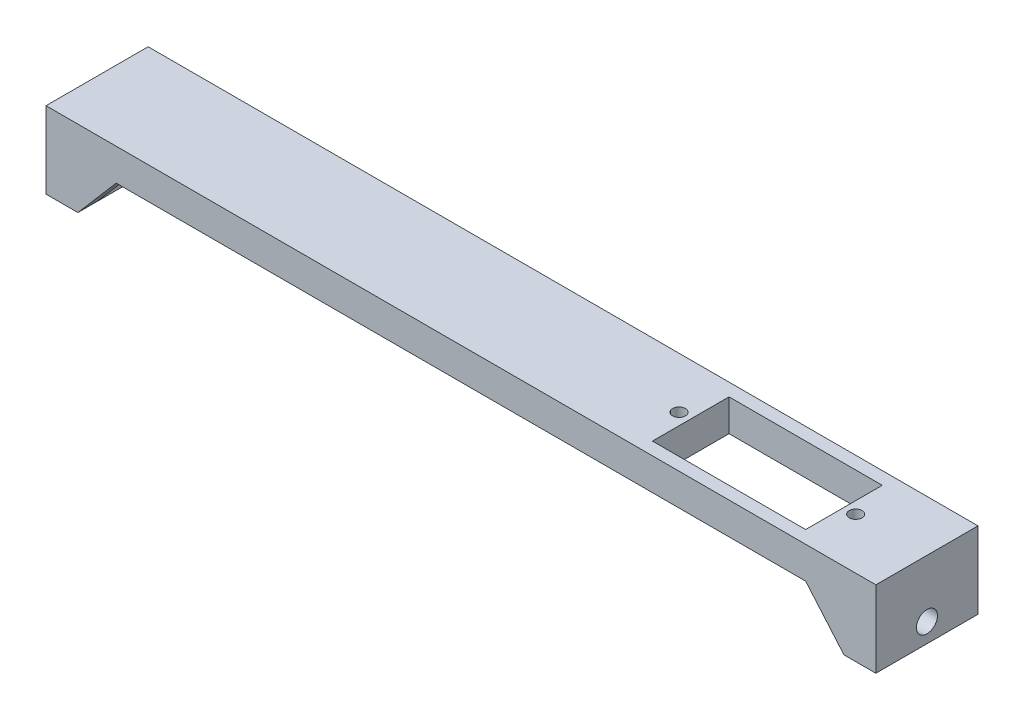
ISO-10303-21;
HEADER;
FILE_DESCRIPTION(('STEP AP214'),'2;1');
FILE_NAME('part.step','',(''),(''),'','','');
FILE_SCHEMA(('AUTOMOTIVE_DESIGN { 1 0 10303 214 1 1 1 1 }'));
ENDSEC;
DATA;
#1=APPLICATION_CONTEXT('core data for automotive mechanical design processes');
#2=APPLICATION_PROTOCOL_DEFINITION('international standard','automotive_design',2000,#1);
#3=PRODUCT_CONTEXT('',#1,'mechanical');
#4=PRODUCT('Part','Part','',(#3));
#5=PRODUCT_RELATED_PRODUCT_CATEGORY('part','',(#4));
#6=PRODUCT_DEFINITION_FORMATION('','',#4);
#7=PRODUCT_DEFINITION_CONTEXT('part definition',#1,'design');
#8=PRODUCT_DEFINITION('design','',#6,#7);
#9=PRODUCT_DEFINITION_SHAPE('','',#8);
#10=(LENGTH_UNIT() NAMED_UNIT(*) SI_UNIT(.MILLI.,.METRE.));
#11=(NAMED_UNIT(*) PLANE_ANGLE_UNIT() SI_UNIT($,.RADIAN.));
#12=(NAMED_UNIT(*) SI_UNIT($,.STERADIAN.) SOLID_ANGLE_UNIT());
#13=UNCERTAINTY_MEASURE_WITH_UNIT(LENGTH_MEASURE(1.E-05),#10,'distance_accuracy_value','');
#14=(GEOMETRIC_REPRESENTATION_CONTEXT(3) GLOBAL_UNCERTAINTY_ASSIGNED_CONTEXT((#13)) GLOBAL_UNIT_ASSIGNED_CONTEXT((#10,
#11,#12)) REPRESENTATION_CONTEXT('',''));
#15=CARTESIAN_POINT('',(0.,0.,0.));
#16=DIRECTION('',(0.,0.,1.));
#17=DIRECTION('',(1.,0.,0.));
#18=AXIS2_PLACEMENT_3D('',#15,#16,#17);
#19=CARTESIAN_POINT('',(60.,-5.00000000000001,16.));
#20=DIRECTION('',(0.,1.,0.));
#21=DIRECTION('',(0.,0.,1.));
#22=AXIS2_PLACEMENT_3D('',#19,#20,#21);
#23=PLANE('',#22);
#24=CARTESIAN_POINT('',(53.835,-5.00000000000001,8.));
#25=DIRECTION('',(0.,-1.,0.));
#26=DIRECTION('',(0.,0.,-1.));
#27=AXIS2_PLACEMENT_3D('',#24,#25,#26);
#28=CIRCLE('',#27,0.999999999999998);
#29=CARTESIAN_POINT('',(53.835,-5.00000000000001,7.));
#30=VERTEX_POINT('',#29);
#31=EDGE_CURVE('E617',#30,#30,#28,.T.);
#32=ORIENTED_EDGE('',*,*,#31,.F.);
#33=EDGE_LOOP('',(#32));
#34=FACE_BOUND('',#33,.T.);
#35=CARTESIAN_POINT('',(26.165,-5.00000000000001,8.));
#36=DIRECTION('',(0.,-1.,0.));
#37=DIRECTION('',(0.,0.,-1.));
#38=AXIS2_PLACEMENT_3D('',#35,#36,#37);
#39=CIRCLE('',#38,1.);
#40=CARTESIAN_POINT('',(26.165,-5.00000000000001,6.99999999999999));
#41=VERTEX_POINT('',#40);
#42=EDGE_CURVE('E185',#41,#41,#39,.T.);
#43=ORIENTED_EDGE('',*,*,#42,.F.);
#44=EDGE_LOOP('',(#43));
#45=FACE_BOUND('',#44,.T.);
#46=DIRECTION('',(-1.,0.,0.));
#47=VECTOR('',#46,1.);
#48=CARTESIAN_POINT('',(52.,-5.00000000000001,14.));
#49=LINE('',#48,#47);
#50=CARTESIAN_POINT('',(52.,-5.00000000000001,14.));
#51=VERTEX_POINT('',#50);
#52=CARTESIAN_POINT('',(28.,-5.00000000000001,14.));
#53=VERTEX_POINT('',#52);
#54=EDGE_CURVE('E191',#51,#53,#49,.T.);
#55=ORIENTED_EDGE('',*,*,#54,.F.);
#56=DIRECTION('',(0.,0.,1.));
#57=VECTOR('',#56,1.);
#58=CARTESIAN_POINT('',(52.,-5.00000000000001,2.));
#59=LINE('',#58,#57);
#60=CARTESIAN_POINT('',(52.,-5.00000000000001,2.));
#61=VERTEX_POINT('',#60);
#62=EDGE_CURVE('E53',#61,#51,#59,.T.);
#63=ORIENTED_EDGE('',*,*,#62,.F.);
#64=DIRECTION('',(-1.,0.,0.));
#65=VECTOR('',#64,1.);
#66=CARTESIAN_POINT('',(52.,-5.00000000000001,2.));
#67=LINE('',#66,#65);
#68=CARTESIAN_POINT('',(28.,-5.00000000000001,2.));
#69=VERTEX_POINT('',#68);
#70=EDGE_CURVE('E179',#61,#69,#67,.T.);
#71=ORIENTED_EDGE('',*,*,#70,.T.);
#72=DIRECTION('',(0.,0.,1.));
#73=VECTOR('',#72,1.);
#74=CARTESIAN_POINT('',(28.,-5.00000000000001,2.));
#75=LINE('',#74,#73);
#76=EDGE_CURVE('E182',#69,#53,#75,.T.);
#77=ORIENTED_EDGE('',*,*,#76,.T.);
#78=EDGE_LOOP('',(#55,#63,#71,#77));
#79=FACE_BOUND('',#78,.T.);
#80=DIRECTION('',(-1.,0.,0.));
#81=VECTOR('',#80,1.);
#82=CARTESIAN_POINT('',(54.,-5.00000000000001,13.));
#83=LINE('',#82,#81);
#84=CARTESIAN_POINT('',(60.,-5.00000000000001,13.));
#85=VERTEX_POINT('',#84);
#86=CARTESIAN_POINT('',(54.,-5.00000000000001,13.));
#87=VERTEX_POINT('',#86);
#88=EDGE_CURVE('E202',#85,#87,#83,.T.);
#89=ORIENTED_EDGE('',*,*,#88,.T.);
#90=DIRECTION('',(0.,0.,1.));
#91=VECTOR('',#90,1.);
#92=CARTESIAN_POINT('',(54.,-5.00000000000001,13.));
#93=LINE('',#92,#91);
#94=CARTESIAN_POINT('',(54.,-5.00000000000001,16.));
#95=VERTEX_POINT('',#94);
#96=EDGE_CURVE('E210',#87,#95,#93,.T.);
#97=ORIENTED_EDGE('',*,*,#96,.T.);
#98=DIRECTION('',(1.,0.,0.));
#99=VECTOR('',#98,1.);
#100=CARTESIAN_POINT('',(60.,-5.00000000000001,16.));
#101=LINE('',#100,#99);
#102=CARTESIAN_POINT('',(-54.,-5.00000000000001,16.));
#103=VERTEX_POINT('',#102);
#104=EDGE_CURVE('E280',#103,#95,#101,.T.);
#105=ORIENTED_EDGE('',*,*,#104,.F.);
#106=DIRECTION('',(0.,0.,1.));
#107=VECTOR('',#106,1.);
#108=CARTESIAN_POINT('',(-54.,-5.00000000000001,13.));
#109=LINE('',#108,#107);
#110=CARTESIAN_POINT('',(-54.,-5.00000000000001,13.));
#111=VERTEX_POINT('',#110);
#112=EDGE_CURVE('E240',#111,#103,#109,.T.);
#113=ORIENTED_EDGE('',*,*,#112,.F.);
#114=DIRECTION('',(1.,0.,0.));
#115=VECTOR('',#114,1.);
#116=CARTESIAN_POINT('',(-54.,-5.00000000000001,13.));
#117=LINE('',#116,#115);
#118=CARTESIAN_POINT('',(-60.,-5.00000000000001,13.));
#119=VERTEX_POINT('',#118);
#120=EDGE_CURVE('E233',#119,#111,#117,.T.);
#121=ORIENTED_EDGE('',*,*,#120,.F.);
#122=DIRECTION('',(0.,0.,-1.));
#123=VECTOR('',#122,1.);
#124=CARTESIAN_POINT('',(-60.,-5.00000000000001,16.));
#125=LINE('',#124,#123);
#126=CARTESIAN_POINT('',(-60.,-5.00000000000001,3.));
#127=VERTEX_POINT('',#126);
#128=EDGE_CURVE('E315',#119,#127,#125,.T.);
#129=ORIENTED_EDGE('',*,*,#128,.T.);
#130=DIRECTION('',(1.,0.,0.));
#131=VECTOR('',#130,1.);
#132=CARTESIAN_POINT('',(-54.,-5.00000000000001,3.));
#133=LINE('',#132,#131);
#134=CARTESIAN_POINT('',(-54.,-5.00000000000001,3.));
#135=VERTEX_POINT('',#134);
#136=EDGE_CURVE('E245',#127,#135,#133,.T.);
#137=ORIENTED_EDGE('',*,*,#136,.T.);
#138=DIRECTION('',(0.,0.,-1.));
#139=VECTOR('',#138,1.);
#140=CARTESIAN_POINT('',(-54.,-5.00000000000001,3.));
#141=LINE('',#140,#139);
#142=CARTESIAN_POINT('',(-54.,-5.,0.));
#143=VERTEX_POINT('',#142);
#144=EDGE_CURVE('E253',#135,#143,#141,.T.);
#145=ORIENTED_EDGE('',*,*,#144,.T.);
#146=DIRECTION('',(1.,0.,0.));
#147=VECTOR('',#146,1.);
#148=CARTESIAN_POINT('',(60.,-5.00000000000001,0.));
#149=LINE('',#148,#147);
#150=CARTESIAN_POINT('',(54.,-5.00000000000002,0.));
#151=VERTEX_POINT('',#150);
#152=EDGE_CURVE('E294',#143,#151,#149,.T.);
#153=ORIENTED_EDGE('',*,*,#152,.T.);
#154=DIRECTION('',(0.,0.,-1.));
#155=VECTOR('',#154,1.);
#156=CARTESIAN_POINT('',(54.,-5.00000000000001,3.));
#157=LINE('',#156,#155);
#158=CARTESIAN_POINT('',(54.,-5.00000000000001,3.));
#159=VERTEX_POINT('',#158);
#160=EDGE_CURVE('E227',#159,#151,#157,.T.);
#161=ORIENTED_EDGE('',*,*,#160,.F.);
#162=DIRECTION('',(-1.,0.,0.));
#163=VECTOR('',#162,1.);
#164=CARTESIAN_POINT('',(54.,-5.00000000000001,3.));
#165=LINE('',#164,#163);
#166=CARTESIAN_POINT('',(60.,-5.00000000000001,3.));
#167=VERTEX_POINT('',#166);
#168=EDGE_CURVE('E215',#167,#159,#165,.T.);
#169=ORIENTED_EDGE('',*,*,#168,.F.);
#170=DIRECTION('',(0.,0.,-1.));
#171=VECTOR('',#170,1.);
#172=CARTESIAN_POINT('',(60.,-5.00000000000001,16.));
#173=LINE('',#172,#171);
#174=EDGE_CURVE('E313',#85,#167,#173,.T.);
#175=ORIENTED_EDGE('',*,*,#174,.F.);
#176=EDGE_LOOP('',(#89,#97,#105,#113,#121,#129,#137,#145,#153,#161,#169,#175));
#177=FACE_BOUND('',#176,.T.);
#178=ADVANCED_FACE('F38',(#34,#45,#79,#177),#23,.F.);
#179=CARTESIAN_POINT('',(-65.,-12.,16.));
#180=DIRECTION('',(1.,0.,0.));
#181=DIRECTION('',(0.,0.,-1.));
#182=AXIS2_PLACEMENT_3D('',#179,#180,#181);
#183=PLANE('',#182);
#184=CARTESIAN_POINT('',(-65.,-8.99999999999999,8.));
#185=DIRECTION('',(1.,0.,0.));
#186=DIRECTION('',(0.,1.,0.));
#187=AXIS2_PLACEMENT_3D('',#184,#185,#186);
#188=CIRCLE('',#187,1.65);
#189=CARTESIAN_POINT('',(-65.,-7.34999999999999,8.));
#190=VERTEX_POINT('',#189);
#191=EDGE_CURVE('E263',#190,#190,#188,.T.);
#192=ORIENTED_EDGE('',*,*,#191,.T.);
#193=EDGE_LOOP('',(#192));
#194=FACE_BOUND('',#193,.T.);
#195=DIRECTION('',(0.,-1.,0.));
#196=VECTOR('',#195,1.);
#197=CARTESIAN_POINT('',(-65.,-12.,0.));
#198=LINE('',#197,#196);
#199=CARTESIAN_POINT('',(-65.,0.,0.));
#200=VERTEX_POINT('',#199);
#201=CARTESIAN_POINT('',(-65.,-12.,0.));
#202=VERTEX_POINT('',#201);
#203=EDGE_CURVE('E272',#200,#202,#198,.T.);
#204=ORIENTED_EDGE('',*,*,#203,.T.);
#205=DIRECTION('',(0.,0.,-1.));
#206=VECTOR('',#205,1.);
#207=CARTESIAN_POINT('',(-65.,-12.,16.));
#208=LINE('',#207,#206);
#209=CARTESIAN_POINT('',(-65.,-12.,16.));
#210=VERTEX_POINT('',#209);
#211=EDGE_CURVE('E11',#210,#202,#208,.T.);
#212=ORIENTED_EDGE('',*,*,#211,.F.);
#213=DIRECTION('',(0.,-1.,0.));
#214=VECTOR('',#213,1.);
#215=CARTESIAN_POINT('',(-65.,-12.,16.));
#216=LINE('',#215,#214);
#217=CARTESIAN_POINT('',(-65.,0.,16.));
#218=VERTEX_POINT('',#217);
#219=EDGE_CURVE('E273',#218,#210,#216,.T.);
#220=ORIENTED_EDGE('',*,*,#219,.F.);
#221=DIRECTION('',(0.,0.,-1.));
#222=VECTOR('',#221,1.);
#223=CARTESIAN_POINT('',(-65.,0.,16.));
#224=LINE('',#223,#222);
#225=EDGE_CURVE('E289',#218,#200,#224,.T.);
#226=ORIENTED_EDGE('',*,*,#225,.T.);
#227=EDGE_LOOP('',(#204,#212,#220,#226));
#228=FACE_BOUND('',#227,.T.);
#229=ADVANCED_FACE('F40',(#194,#228),#183,.F.);
#230=CARTESIAN_POINT('',(-60.,-12.,16.));
#231=DIRECTION('',(0.,1.,0.));
#232=DIRECTION('',(-1.,0.,0.));
#233=AXIS2_PLACEMENT_3D('',#230,#231,#232);
#234=PLANE('',#233);
#235=DIRECTION('',(1.,0.,0.));
#236=VECTOR('',#235,1.);
#237=CARTESIAN_POINT('',(-60.,-12.,0.));
#238=LINE('',#237,#236);
#239=CARTESIAN_POINT('',(-60.,-12.,0.));
#240=VERTEX_POINT('',#239);
#241=EDGE_CURVE('E292',#202,#240,#238,.T.);
#242=ORIENTED_EDGE('',*,*,#241,.T.);
#243=DIRECTION('',(0.,0.,-1.));
#244=VECTOR('',#243,1.);
#245=CARTESIAN_POINT('',(-60.,-12.,3.));
#246=LINE('',#245,#244);
#247=CARTESIAN_POINT('',(-60.,-12.,3.));
#248=VERTEX_POINT('',#247);
#249=EDGE_CURVE('E256',#248,#240,#246,.T.);
#250=ORIENTED_EDGE('',*,*,#249,.F.);
#251=DIRECTION('',(0.,0.,-1.));
#252=VECTOR('',#251,1.);
#253=CARTESIAN_POINT('',(-60.,-12.,16.));
#254=LINE('',#253,#252);
#255=CARTESIAN_POINT('',(-60.,-12.,13.));
#256=VERTEX_POINT('',#255);
#257=EDGE_CURVE('E316',#256,#248,#254,.T.);
#258=ORIENTED_EDGE('',*,*,#257,.F.);
#259=CARTESIAN_POINT('',(-60.,-12.,16.));
#260=VERTEX_POINT('',#259);
#261=EDGE_CURVE('E46',#260,#256,#254,.T.);
#262=ORIENTED_EDGE('',*,*,#261,.F.);
#263=DIRECTION('',(1.,0.,0.));
#264=VECTOR('',#263,1.);
#265=CARTESIAN_POINT('',(-60.,-12.,16.));
#266=LINE('',#265,#264);
#267=EDGE_CURVE('E276',#210,#260,#266,.T.);
#268=ORIENTED_EDGE('',*,*,#267,.F.);
#269=ORIENTED_EDGE('',*,*,#211,.T.);
#270=EDGE_LOOP('',(#242,#250,#258,#262,#268,#269));
#271=FACE_BOUND('',#270,.T.);
#272=ADVANCED_FACE('F329',(#271),#234,.F.);
#273=CARTESIAN_POINT('',(-60.,-5.00000000000001,16.));
#274=DIRECTION('',(-1.,0.,0.));
#275=DIRECTION('',(0.,-1.,0.));
#276=AXIS2_PLACEMENT_3D('',#273,#274,#275);
#277=PLANE('',#276);
#278=CARTESIAN_POINT('',(-60.,-9.,8.));
#279=DIRECTION('',(-1.,0.,0.));
#280=DIRECTION('',(0.,-1.,0.));
#281=AXIS2_PLACEMENT_3D('',#278,#279,#280);
#282=CIRCLE('',#281,1.65);
#283=CARTESIAN_POINT('',(-60.,-10.65,8.));
#284=VERTEX_POINT('',#283);
#285=EDGE_CURVE('E269',#284,#284,#282,.T.);
#286=ORIENTED_EDGE('',*,*,#285,.T.);
#287=EDGE_LOOP('',(#286));
#288=FACE_BOUND('',#287,.T.);
#289=ORIENTED_EDGE('',*,*,#128,.F.);
#290=DIRECTION('',(0.,1.,0.));
#291=VECTOR('',#290,1.);
#292=CARTESIAN_POINT('',(-60.,-5.00000000000001,13.));
#293=LINE('',#292,#291);
#294=EDGE_CURVE('E236',#256,#119,#293,.T.);
#295=ORIENTED_EDGE('',*,*,#294,.F.);
#296=ORIENTED_EDGE('',*,*,#257,.T.);
#297=DIRECTION('',(0.,1.,0.));
#298=VECTOR('',#297,1.);
#299=CARTESIAN_POINT('',(-60.,-5.00000000000001,3.));
#300=LINE('',#299,#298);
#301=EDGE_CURVE('E250',#248,#127,#300,.T.);
#302=ORIENTED_EDGE('',*,*,#301,.T.);
#303=EDGE_LOOP('',(#289,#295,#296,#302));
#304=FACE_BOUND('',#303,.T.);
#305=ADVANCED_FACE('F325',(#288,#304),#277,.F.);
#306=CARTESIAN_POINT('',(60.,-12.,16.));
#307=DIRECTION('',(1.,0.,0.));
#308=DIRECTION('',(0.,1.,0.));
#309=AXIS2_PLACEMENT_3D('',#306,#307,#308);
#310=PLANE('',#309);
#311=CARTESIAN_POINT('',(60.,-9.00000000000007,8.));
#312=DIRECTION('',(1.,0.,0.));
#313=DIRECTION('',(0.,1.,0.));
#314=AXIS2_PLACEMENT_3D('',#311,#312,#313);
#315=CIRCLE('',#314,1.65);
#316=CARTESIAN_POINT('',(60.,-7.35000000000007,8.));
#317=VERTEX_POINT('',#316);
#318=EDGE_CURVE('E266',#317,#317,#315,.T.);
#319=ORIENTED_EDGE('',*,*,#318,.T.);
#320=EDGE_LOOP('',(#319));
#321=FACE_BOUND('',#320,.T.);
#322=DIRECTION('',(0.,0.,-1.));
#323=VECTOR('',#322,1.);
#324=CARTESIAN_POINT('',(60.,-12.,16.));
#325=LINE('',#324,#323);
#326=CARTESIAN_POINT('',(60.,-12.,13.));
#327=VERTEX_POINT('',#326);
#328=CARTESIAN_POINT('',(60.,-12.,3.));
#329=VERTEX_POINT('',#328);
#330=EDGE_CURVE('E309',#327,#329,#325,.T.);
#331=ORIENTED_EDGE('',*,*,#330,.F.);
#332=DIRECTION('',(0.,1.,0.));
#333=VECTOR('',#332,1.);
#334=CARTESIAN_POINT('',(60.,-5.00000000000001,13.));
#335=LINE('',#334,#333);
#336=EDGE_CURVE('E207',#327,#85,#335,.T.);
#337=ORIENTED_EDGE('',*,*,#336,.T.);
#338=ORIENTED_EDGE('',*,*,#174,.T.);
#339=DIRECTION('',(0.,1.,0.));
#340=VECTOR('',#339,1.);
#341=CARTESIAN_POINT('',(60.,-5.00000000000001,3.));
#342=LINE('',#341,#340);
#343=EDGE_CURVE('E218',#329,#167,#342,.T.);
#344=ORIENTED_EDGE('',*,*,#343,.F.);
#345=EDGE_LOOP('',(#331,#337,#338,#344));
#346=FACE_BOUND('',#345,.T.);
#347=ADVANCED_FACE('F369',(#321,#346),#310,.F.);
#348=CARTESIAN_POINT('',(65.,-12.,16.));
#349=DIRECTION('',(0.,1.,0.));
#350=DIRECTION('',(0.,0.,1.));
#351=AXIS2_PLACEMENT_3D('',#348,#349,#350);
#352=PLANE('',#351);
#353=DIRECTION('',(1.,0.,0.));
#354=VECTOR('',#353,1.);
#355=CARTESIAN_POINT('',(65.,-12.,0.));
#356=LINE('',#355,#354);
#357=CARTESIAN_POINT('',(60.,-12.,0.));
#358=VERTEX_POINT('',#357);
#359=CARTESIAN_POINT('',(65.,-12.,0.));
#360=VERTEX_POINT('',#359);
#361=EDGE_CURVE('E296',#358,#360,#356,.T.);
#362=ORIENTED_EDGE('',*,*,#361,.T.);
#363=DIRECTION('',(0.,0.,-1.));
#364=VECTOR('',#363,1.);
#365=CARTESIAN_POINT('',(65.,-12.,16.));
#366=LINE('',#365,#364);
#367=CARTESIAN_POINT('',(65.,-12.,16.));
#368=VERTEX_POINT('',#367);
#369=EDGE_CURVE('E306',#368,#360,#366,.T.);
#370=ORIENTED_EDGE('',*,*,#369,.F.);
#371=DIRECTION('',(1.,0.,0.));
#372=VECTOR('',#371,1.);
#373=CARTESIAN_POINT('',(65.,-12.,16.));
#374=LINE('',#373,#372);
#375=CARTESIAN_POINT('',(60.,-12.,16.));
#376=VERTEX_POINT('',#375);
#377=EDGE_CURVE('E283',#376,#368,#374,.T.);
#378=ORIENTED_EDGE('',*,*,#377,.F.);
#379=EDGE_CURVE('E310',#376,#327,#325,.T.);
#380=ORIENTED_EDGE('',*,*,#379,.T.);
#381=ORIENTED_EDGE('',*,*,#330,.T.);
#382=DIRECTION('',(0.,0.,-1.));
#383=VECTOR('',#382,1.);
#384=CARTESIAN_POINT('',(60.,-12.,3.));
#385=LINE('',#384,#383);
#386=EDGE_CURVE('E224',#329,#358,#385,.T.);
#387=ORIENTED_EDGE('',*,*,#386,.T.);
#388=EDGE_LOOP('',(#362,#370,#378,#380,#381,#387));
#389=FACE_BOUND('',#388,.T.);
#390=ADVANCED_FACE('F379',(#389),#352,.F.);
#391=CARTESIAN_POINT('',(65.,0.,16.));
#392=DIRECTION('',(-1.,0.,0.));
#393=DIRECTION('',(0.,0.,1.));
#394=AXIS2_PLACEMENT_3D('',#391,#392,#393);
#395=PLANE('',#394);
#396=CARTESIAN_POINT('',(65.,-9.00000000000007,8.));
#397=DIRECTION('',(1.,0.,0.));
#398=DIRECTION('',(0.,1.,0.));
#399=AXIS2_PLACEMENT_3D('',#396,#397,#398);
#400=CIRCLE('',#399,1.65);
#401=CARTESIAN_POINT('',(65.,-7.35000000000007,8.));
#402=VERTEX_POINT('',#401);
#403=EDGE_CURVE('E259',#402,#402,#400,.T.);
#404=ORIENTED_EDGE('',*,*,#403,.F.);
#405=EDGE_LOOP('',(#404));
#406=FACE_BOUND('',#405,.T.);
#407=DIRECTION('',(0.,1.,0.));
#408=VECTOR('',#407,1.);
#409=CARTESIAN_POINT('',(65.,0.,0.));
#410=LINE('',#409,#408);
#411=CARTESIAN_POINT('',(65.,0.,0.));
#412=VERTEX_POINT('',#411);
#413=EDGE_CURVE('E298',#360,#412,#410,.T.);
#414=ORIENTED_EDGE('',*,*,#413,.T.);
#415=DIRECTION('',(0.,0.,-1.));
#416=VECTOR('',#415,1.);
#417=CARTESIAN_POINT('',(65.,0.,16.));
#418=LINE('',#417,#416);
#419=CARTESIAN_POINT('',(65.,0.,16.));
#420=VERTEX_POINT('',#419);
#421=EDGE_CURVE('E303',#420,#412,#418,.T.);
#422=ORIENTED_EDGE('',*,*,#421,.F.);
#423=DIRECTION('',(0.,1.,0.));
#424=VECTOR('',#423,1.);
#425=CARTESIAN_POINT('',(65.,0.,16.));
#426=LINE('',#425,#424);
#427=EDGE_CURVE('E285',#368,#420,#426,.T.);
#428=ORIENTED_EDGE('',*,*,#427,.F.);
#429=ORIENTED_EDGE('',*,*,#369,.T.);
#430=EDGE_LOOP('',(#414,#422,#428,#429));
#431=FACE_BOUND('',#430,.T.);
#432=ADVANCED_FACE('F384',(#406,#431),#395,.F.);
#433=CARTESIAN_POINT('',(-65.,0.,16.));
#434=DIRECTION('',(0.,-1.,0.));
#435=DIRECTION('',(0.,0.,-1.));
#436=AXIS2_PLACEMENT_3D('',#433,#434,#435);
#437=PLANE('',#436);
#438=CARTESIAN_POINT('',(53.835,0.,8.));
#439=DIRECTION('',(0.,-1.,0.));
#440=DIRECTION('',(0.,0.,-1.));
#441=AXIS2_PLACEMENT_3D('',#438,#439,#440);
#442=CIRCLE('',#441,0.999999999999998);
#443=CARTESIAN_POINT('',(53.835,0.,7.));
#444=VERTEX_POINT('',#443);
#445=EDGE_CURVE('E192',#444,#444,#442,.T.);
#446=ORIENTED_EDGE('',*,*,#445,.T.);
#447=EDGE_LOOP('',(#446));
#448=FACE_BOUND('',#447,.T.);
#449=CARTESIAN_POINT('',(26.165,0.,8.));
#450=DIRECTION('',(0.,-1.,0.));
#451=DIRECTION('',(0.,0.,-1.));
#452=AXIS2_PLACEMENT_3D('',#449,#450,#451);
#453=CIRCLE('',#452,1.);
#454=CARTESIAN_POINT('',(26.165,0.,6.99999999999999));
#455=VERTEX_POINT('',#454);
#456=EDGE_CURVE('E618',#455,#455,#453,.T.);
#457=ORIENTED_EDGE('',*,*,#456,.T.);
#458=EDGE_LOOP('',(#457));
#459=FACE_BOUND('',#458,.T.);
#460=DIRECTION('',(-1.,0.,0.));
#461=VECTOR('',#460,1.);
#462=CARTESIAN_POINT('',(52.,0.,2.));
#463=LINE('',#462,#461);
#464=CARTESIAN_POINT('',(52.,0.,2.));
#465=VERTEX_POINT('',#464);
#466=CARTESIAN_POINT('',(28.,0.,2.));
#467=VERTEX_POINT('',#466);
#468=EDGE_CURVE('E168',#465,#467,#463,.T.);
#469=ORIENTED_EDGE('',*,*,#468,.F.);
#470=DIRECTION('',(0.,0.,1.));
#471=VECTOR('',#470,1.);
#472=CARTESIAN_POINT('',(52.,0.,2.));
#473=LINE('',#472,#471);
#474=CARTESIAN_POINT('',(52.,0.,14.));
#475=VERTEX_POINT('',#474);
#476=EDGE_CURVE('E165',#465,#475,#473,.T.);
#477=ORIENTED_EDGE('',*,*,#476,.T.);
#478=DIRECTION('',(-1.,0.,0.));
#479=VECTOR('',#478,1.);
#480=CARTESIAN_POINT('',(52.,0.,14.));
#481=LINE('',#480,#479);
#482=CARTESIAN_POINT('',(28.,0.,14.));
#483=VERTEX_POINT('',#482);
#484=EDGE_CURVE('E171',#475,#483,#481,.T.);
#485=ORIENTED_EDGE('',*,*,#484,.T.);
#486=DIRECTION('',(0.,0.,1.));
#487=VECTOR('',#486,1.);
#488=CARTESIAN_POINT('',(28.,0.,2.));
#489=LINE('',#488,#487);
#490=EDGE_CURVE('E175',#467,#483,#489,.T.);
#491=ORIENTED_EDGE('',*,*,#490,.F.);
#492=EDGE_LOOP('',(#469,#477,#485,#491));
#493=FACE_BOUND('',#492,.T.);
#494=DIRECTION('',(-1.,0.,0.));
#495=VECTOR('',#494,1.);
#496=CARTESIAN_POINT('',(-65.,0.,0.));
#497=LINE('',#496,#495);
#498=EDGE_CURVE('E277',#412,#200,#497,.T.);
#499=ORIENTED_EDGE('',*,*,#498,.T.);
#500=ORIENTED_EDGE('',*,*,#225,.F.);
#501=DIRECTION('',(-1.,0.,0.));
#502=VECTOR('',#501,1.);
#503=CARTESIAN_POINT('',(-65.,0.,16.));
#504=LINE('',#503,#502);
#505=EDGE_CURVE('E287',#420,#218,#504,.T.);
#506=ORIENTED_EDGE('',*,*,#505,.F.);
#507=ORIENTED_EDGE('',*,*,#421,.T.);
#508=EDGE_LOOP('',(#499,#500,#506,#507));
#509=FACE_BOUND('',#508,.T.);
#510=ADVANCED_FACE('F177',(#448,#459,#493,#509),#437,.F.);
#511=CARTESIAN_POINT('',(0.,0.,16.));
#512=DIRECTION('',(0.,0.,-1.));
#513=DIRECTION('',(-1.,0.,0.));
#514=AXIS2_PLACEMENT_3D('',#511,#512,#513);
#515=PLANE('',#514);
#516=ORIENTED_EDGE('',*,*,#104,.T.);
#517=DIRECTION('',(0.65079137345597,-0.759256602365296,0.));
#518=VECTOR('',#517,1.);
#519=CARTESIAN_POINT('',(54.,-5.00000000000001,16.));
#520=LINE('',#519,#518);
#521=EDGE_CURVE('E198',#95,#376,#520,.T.);
#522=ORIENTED_EDGE('',*,*,#521,.T.);
#523=ORIENTED_EDGE('',*,*,#377,.T.);
#524=ORIENTED_EDGE('',*,*,#427,.T.);
#525=ORIENTED_EDGE('',*,*,#505,.T.);
#526=ORIENTED_EDGE('',*,*,#219,.T.);
#527=ORIENTED_EDGE('',*,*,#267,.T.);
#528=DIRECTION('',(-0.65079137345597,-0.759256602365296,0.));
#529=VECTOR('',#528,1.);
#530=CARTESIAN_POINT('',(-54.,-5.00000000000001,16.));
#531=LINE('',#530,#529);
#532=EDGE_CURVE('E230',#103,#260,#531,.T.);
#533=ORIENTED_EDGE('',*,*,#532,.F.);
#534=EDGE_LOOP('',(#516,#522,#523,#524,#525,#526,#527,#533));
#535=FACE_BOUND('',#534,.T.);
#536=ADVANCED_FACE('F346',(#535),#515,.F.);
#537=CARTESIAN_POINT('',(0.,0.,0.));
#538=DIRECTION('',(0.,0.,-1.));
#539=DIRECTION('',(-1.,0.,0.));
#540=AXIS2_PLACEMENT_3D('',#537,#538,#539);
#541=PLANE('',#540);
#542=DIRECTION('',(0.65079137345597,-0.759256602365296,0.));
#543=VECTOR('',#542,1.);
#544=CARTESIAN_POINT('',(54.,-5.00000000000001,0.));
#545=LINE('',#544,#543);
#546=EDGE_CURVE('E214',#151,#358,#545,.T.);
#547=ORIENTED_EDGE('',*,*,#546,.F.);
#548=ORIENTED_EDGE('',*,*,#152,.F.);
#549=DIRECTION('',(-0.65079137345597,-0.759256602365296,0.));
#550=VECTOR('',#549,1.);
#551=CARTESIAN_POINT('',(-54.,-5.00000000000001,0.));
#552=LINE('',#551,#550);
#553=EDGE_CURVE('E244',#143,#240,#552,.T.);
#554=ORIENTED_EDGE('',*,*,#553,.T.);
#555=ORIENTED_EDGE('',*,*,#241,.F.);
#556=ORIENTED_EDGE('',*,*,#203,.F.);
#557=ORIENTED_EDGE('',*,*,#498,.F.);
#558=ORIENTED_EDGE('',*,*,#413,.F.);
#559=ORIENTED_EDGE('',*,*,#361,.F.);
#560=EDGE_LOOP('',(#547,#548,#554,#555,#556,#557,#558,#559));
#561=FACE_BOUND('',#560,.T.);
#562=ADVANCED_FACE('F356',(#561),#541,.T.);
#563=CARTESIAN_POINT('',(-65.,-8.99999999999999,8.));
#564=DIRECTION('',(1.,0.,0.));
#565=DIRECTION('',(0.,1.,0.));
#566=AXIS2_PLACEMENT_3D('',#563,#564,#565);
#567=CYLINDRICAL_SURFACE('',#566,1.65);
#568=ORIENTED_EDGE('',*,*,#403,.T.);
#569=EDGE_LOOP('',(#568));
#570=FACE_BOUND('',#569,.T.);
#571=ORIENTED_EDGE('',*,*,#318,.F.);
#572=EDGE_LOOP('',(#571));
#573=FACE_BOUND('',#572,.T.);
#574=ADVANCED_FACE('F448',(#570,#573),#567,.F.);
#575=ORIENTED_EDGE('',*,*,#191,.F.);
#576=EDGE_LOOP('',(#575));
#577=FACE_BOUND('',#576,.T.);
#578=ORIENTED_EDGE('',*,*,#285,.F.);
#579=EDGE_LOOP('',(#578));
#580=FACE_BOUND('',#579,.T.);
#581=ADVANCED_FACE('F453',(#577,#580),#567,.F.);
#582=CARTESIAN_POINT('',(-54.,-5.00000000000001,3.));
#583=DIRECTION('',(0.759256602365296,-0.650791373455969,0.));
#584=DIRECTION('',(0.65079137345597,0.759256602365296,0.));
#585=AXIS2_PLACEMENT_3D('',#582,#583,#584);
#586=PLANE('',#585);
#587=ORIENTED_EDGE('',*,*,#553,.F.);
#588=ORIENTED_EDGE('',*,*,#144,.F.);
#589=DIRECTION('',(-0.65079137345597,-0.759256602365296,0.));
#590=VECTOR('',#589,1.);
#591=CARTESIAN_POINT('',(-54.,-5.00000000000001,3.));
#592=LINE('',#591,#590);
#593=EDGE_CURVE('E247',#135,#248,#592,.T.);
#594=ORIENTED_EDGE('',*,*,#593,.T.);
#595=ORIENTED_EDGE('',*,*,#249,.T.);
#596=EDGE_LOOP('',(#587,#588,#594,#595));
#597=FACE_BOUND('',#596,.T.);
#598=ADVANCED_FACE('F334',(#597),#586,.T.);
#599=CARTESIAN_POINT('',(0.,0.,3.));
#600=DIRECTION('',(0.,0.,1.));
#601=DIRECTION('',(1.,0.,0.));
#602=AXIS2_PLACEMENT_3D('',#599,#600,#601);
#603=PLANE('',#602);
#604=ORIENTED_EDGE('',*,*,#136,.F.);
#605=ORIENTED_EDGE('',*,*,#301,.F.);
#606=ORIENTED_EDGE('',*,*,#593,.F.);
#607=EDGE_LOOP('',(#604,#605,#606));
#608=FACE_BOUND('',#607,.T.);
#609=ADVANCED_FACE('F336',(#608),#603,.T.);
#610=CARTESIAN_POINT('',(-54.,-5.00000000000001,13.));
#611=DIRECTION('',(-0.759256602365296,0.650791373455969,0.));
#612=DIRECTION('',(-0.65079137345597,-0.759256602365296,0.));
#613=AXIS2_PLACEMENT_3D('',#610,#611,#612);
#614=PLANE('',#613);
#615=ORIENTED_EDGE('',*,*,#532,.T.);
#616=ORIENTED_EDGE('',*,*,#261,.T.);
#617=DIRECTION('',(-0.65079137345597,-0.759256602365296,0.));
#618=VECTOR('',#617,1.);
#619=CARTESIAN_POINT('',(-54.,-5.00000000000001,13.));
#620=LINE('',#619,#618);
#621=EDGE_CURVE('E238',#111,#256,#620,.T.);
#622=ORIENTED_EDGE('',*,*,#621,.F.);
#623=ORIENTED_EDGE('',*,*,#112,.T.);
#624=EDGE_LOOP('',(#615,#616,#622,#623));
#625=FACE_BOUND('',#624,.T.);
#626=ADVANCED_FACE('F344',(#625),#614,.F.);
#627=CARTESIAN_POINT('',(0.,0.,13.));
#628=DIRECTION('',(0.,0.,-1.));
#629=DIRECTION('',(1.,0.,0.));
#630=AXIS2_PLACEMENT_3D('',#627,#628,#629);
#631=PLANE('',#630);
#632=ORIENTED_EDGE('',*,*,#120,.T.);
#633=ORIENTED_EDGE('',*,*,#621,.T.);
#634=ORIENTED_EDGE('',*,*,#294,.T.);
#635=EDGE_LOOP('',(#632,#633,#634));
#636=FACE_BOUND('',#635,.T.);
#637=ADVANCED_FACE('F343',(#636),#631,.T.);
#638=CARTESIAN_POINT('',(54.,-5.00000000000001,3.));
#639=DIRECTION('',(0.759256602365296,0.650791373455969,0.));
#640=DIRECTION('',(-0.65079137345597,0.759256602365296,0.));
#641=AXIS2_PLACEMENT_3D('',#638,#639,#640);
#642=PLANE('',#641);
#643=ORIENTED_EDGE('',*,*,#546,.T.);
#644=ORIENTED_EDGE('',*,*,#386,.F.);
#645=DIRECTION('',(0.65079137345597,-0.759256602365296,0.));
#646=VECTOR('',#645,1.);
#647=CARTESIAN_POINT('',(54.,-5.00000000000001,3.));
#648=LINE('',#647,#646);
#649=EDGE_CURVE('E221',#159,#329,#648,.T.);
#650=ORIENTED_EDGE('',*,*,#649,.F.);
#651=ORIENTED_EDGE('',*,*,#160,.T.);
#652=EDGE_LOOP('',(#643,#644,#650,#651));
#653=FACE_BOUND('',#652,.T.);
#654=ADVANCED_FACE('F363',(#653),#642,.F.);
#655=CARTESIAN_POINT('',(0.,0.,3.));
#656=DIRECTION('',(0.,0.,1.));
#657=DIRECTION('',(-1.,0.,0.));
#658=AXIS2_PLACEMENT_3D('',#655,#656,#657);
#659=PLANE('',#658);
#660=ORIENTED_EDGE('',*,*,#168,.T.);
#661=ORIENTED_EDGE('',*,*,#649,.T.);
#662=ORIENTED_EDGE('',*,*,#343,.T.);
#663=EDGE_LOOP('',(#660,#661,#662));
#664=FACE_BOUND('',#663,.T.);
#665=ADVANCED_FACE('F365',(#664),#659,.T.);
#666=CARTESIAN_POINT('',(54.,-5.00000000000001,13.));
#667=DIRECTION('',(-0.759256602365296,-0.650791373455969,0.));
#668=DIRECTION('',(0.65079137345597,-0.759256602365296,0.));
#669=AXIS2_PLACEMENT_3D('',#666,#667,#668);
#670=PLANE('',#669);
#671=ORIENTED_EDGE('',*,*,#521,.F.);
#672=ORIENTED_EDGE('',*,*,#96,.F.);
#673=DIRECTION('',(0.65079137345597,-0.759256602365296,0.));
#674=VECTOR('',#673,1.);
#675=CARTESIAN_POINT('',(54.,-5.00000000000001,13.));
#676=LINE('',#675,#674);
#677=EDGE_CURVE('E205',#87,#327,#676,.T.);
#678=ORIENTED_EDGE('',*,*,#677,.T.);
#679=ORIENTED_EDGE('',*,*,#379,.F.);
#680=EDGE_LOOP('',(#671,#672,#678,#679));
#681=FACE_BOUND('',#680,.T.);
#682=ADVANCED_FACE('F375',(#681),#670,.T.);
#683=CARTESIAN_POINT('',(0.,0.,13.));
#684=DIRECTION('',(0.,0.,-1.));
#685=DIRECTION('',(-1.,0.,0.));
#686=AXIS2_PLACEMENT_3D('',#683,#684,#685);
#687=PLANE('',#686);
#688=ORIENTED_EDGE('',*,*,#88,.F.);
#689=ORIENTED_EDGE('',*,*,#336,.F.);
#690=ORIENTED_EDGE('',*,*,#677,.F.);
#691=EDGE_LOOP('',(#688,#689,#690));
#692=FACE_BOUND('',#691,.T.);
#693=ADVANCED_FACE('F373',(#692),#687,.T.);
#694=CARTESIAN_POINT('',(52.,0.,2.));
#695=DIRECTION('',(1.,0.,0.));
#696=DIRECTION('',(0.,0.,-1.));
#697=AXIS2_PLACEMENT_3D('',#694,#695,#696);
#698=PLANE('',#697);
#699=ORIENTED_EDGE('',*,*,#62,.T.);
#700=DIRECTION('',(0.,-1.,0.));
#701=VECTOR('',#700,1.);
#702=CARTESIAN_POINT('',(52.,0.,14.));
#703=LINE('',#702,#701);
#704=EDGE_CURVE('E162',#475,#51,#703,.T.);
#705=ORIENTED_EDGE('',*,*,#704,.F.);
#706=ORIENTED_EDGE('',*,*,#476,.F.);
#707=DIRECTION('',(0.,-1.,0.));
#708=VECTOR('',#707,1.);
#709=CARTESIAN_POINT('',(52.,0.,2.));
#710=LINE('',#709,#708);
#711=EDGE_CURVE('E196',#465,#61,#710,.T.);
#712=ORIENTED_EDGE('',*,*,#711,.T.);
#713=EDGE_LOOP('',(#699,#705,#706,#712));
#714=FACE_BOUND('',#713,.T.);
#715=ADVANCED_FACE('F163',(#714),#698,.F.);
#716=CARTESIAN_POINT('',(52.,0.,2.));
#717=DIRECTION('',(0.,0.,1.));
#718=DIRECTION('',(1.,0.,0.));
#719=AXIS2_PLACEMENT_3D('',#716,#717,#718);
#720=PLANE('',#719);
#721=ORIENTED_EDGE('',*,*,#70,.F.);
#722=ORIENTED_EDGE('',*,*,#711,.F.);
#723=ORIENTED_EDGE('',*,*,#468,.T.);
#724=DIRECTION('',(0.,-1.,0.));
#725=VECTOR('',#724,1.);
#726=CARTESIAN_POINT('',(28.,0.,2.));
#727=LINE('',#726,#725);
#728=EDGE_CURVE('E199',#467,#69,#727,.T.);
#729=ORIENTED_EDGE('',*,*,#728,.T.);
#730=EDGE_LOOP('',(#721,#722,#723,#729));
#731=FACE_BOUND('',#730,.T.);
#732=ADVANCED_FACE('F524',(#731),#720,.T.);
#733=CARTESIAN_POINT('',(28.,0.,2.));
#734=DIRECTION('',(1.,0.,0.));
#735=DIRECTION('',(0.,0.,-1.));
#736=AXIS2_PLACEMENT_3D('',#733,#734,#735);
#737=PLANE('',#736);
#738=ORIENTED_EDGE('',*,*,#76,.F.);
#739=ORIENTED_EDGE('',*,*,#728,.F.);
#740=ORIENTED_EDGE('',*,*,#490,.T.);
#741=DIRECTION('',(0.,-1.,0.));
#742=VECTOR('',#741,1.);
#743=CARTESIAN_POINT('',(28.,0.,14.));
#744=LINE('',#743,#742);
#745=EDGE_CURVE('E61',#483,#53,#744,.T.);
#746=ORIENTED_EDGE('',*,*,#745,.T.);
#747=EDGE_LOOP('',(#738,#739,#740,#746));
#748=FACE_BOUND('',#747,.T.);
#749=ADVANCED_FACE('F531',(#748),#737,.T.);
#750=CARTESIAN_POINT('',(52.,0.,14.));
#751=DIRECTION('',(0.,0.,1.));
#752=DIRECTION('',(1.,0.,0.));
#753=AXIS2_PLACEMENT_3D('',#750,#751,#752);
#754=PLANE('',#753);
#755=ORIENTED_EDGE('',*,*,#54,.T.);
#756=ORIENTED_EDGE('',*,*,#745,.F.);
#757=ORIENTED_EDGE('',*,*,#484,.F.);
#758=ORIENTED_EDGE('',*,*,#704,.T.);
#759=EDGE_LOOP('',(#755,#756,#757,#758));
#760=FACE_BOUND('',#759,.T.);
#761=ADVANCED_FACE('F172',(#760),#754,.F.);
#762=CARTESIAN_POINT('',(26.165,0.,8.));
#763=DIRECTION('',(0.,-1.,0.));
#764=DIRECTION('',(0.,0.,-1.));
#765=AXIS2_PLACEMENT_3D('',#762,#763,#764);
#766=CYLINDRICAL_SURFACE('',#765,1.);
#767=ORIENTED_EDGE('',*,*,#456,.F.);
#768=EDGE_LOOP('',(#767));
#769=FACE_BOUND('',#768,.T.);
#770=ORIENTED_EDGE('',*,*,#42,.T.);
#771=EDGE_LOOP('',(#770));
#772=FACE_BOUND('',#771,.T.);
#773=ADVANCED_FACE('F546',(#769,#772),#766,.F.);
#774=CARTESIAN_POINT('',(53.835,0.,8.));
#775=DIRECTION('',(0.,-1.,0.));
#776=DIRECTION('',(0.,0.,-1.));
#777=AXIS2_PLACEMENT_3D('',#774,#775,#776);
#778=CYLINDRICAL_SURFACE('',#777,0.999999999999998);
#779=ORIENTED_EDGE('',*,*,#445,.F.);
#780=EDGE_LOOP('',(#779));
#781=FACE_BOUND('',#780,.T.);
#782=ORIENTED_EDGE('',*,*,#31,.T.);
#783=EDGE_LOOP('',(#782));
#784=FACE_BOUND('',#783,.T.);
#785=ADVANCED_FACE('F553',(#781,#784),#778,.F.);
#786=CLOSED_SHELL('',(#178,#229,#272,#305,#347,#390,#432,#510,#536,#562,#574,#581,#598,#609,
#626,#637,#654,#665,#682,#693,#715,#732,#749,#761,#773,#785));
#787=MANIFOLD_SOLID_BREP('B2',#786);
#788=ADVANCED_BREP_SHAPE_REPRESENTATION('',(#18,#787),#14);
#789=SHAPE_DEFINITION_REPRESENTATION(#9,#788);
ENDSEC;
END-ISO-10303-21;
